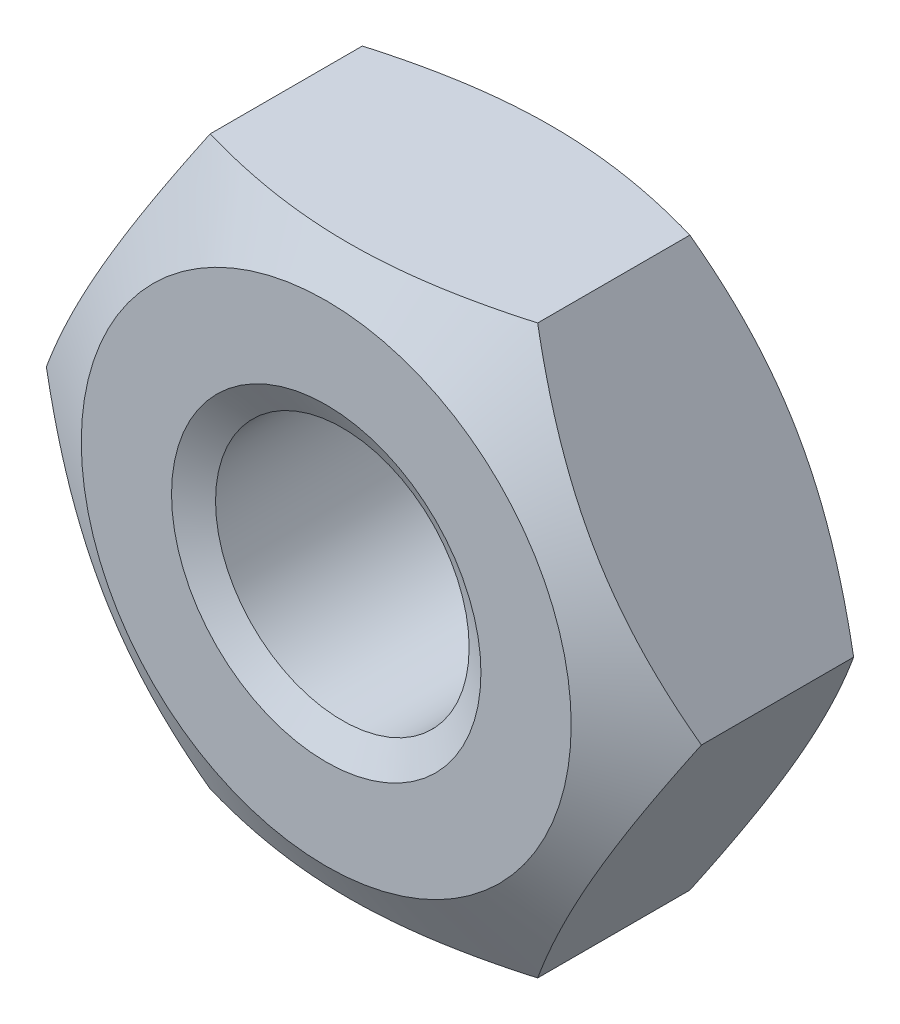
ISO-10303-21;
HEADER;
FILE_DESCRIPTION(('STEP AP214'),'2;1');
FILE_NAME('part.step','',(''),(''),'','','');
FILE_SCHEMA(('AUTOMOTIVE_DESIGN { 1 0 10303 214 1 1 1 1 }'));
ENDSEC;
DATA;
#1=APPLICATION_CONTEXT('core data for automotive mechanical design processes');
#2=APPLICATION_PROTOCOL_DEFINITION('international standard','automotive_design',2000,#1);
#3=PRODUCT_CONTEXT('',#1,'mechanical');
#4=PRODUCT('Part','Part','',(#3));
#5=PRODUCT_RELATED_PRODUCT_CATEGORY('part','',(#4));
#6=PRODUCT_DEFINITION_FORMATION('','',#4);
#7=PRODUCT_DEFINITION_CONTEXT('part definition',#1,'design');
#8=PRODUCT_DEFINITION('design','',#6,#7);
#9=PRODUCT_DEFINITION_SHAPE('','',#8);
#10=(LENGTH_UNIT() NAMED_UNIT(*) SI_UNIT(.MILLI.,.METRE.));
#11=(NAMED_UNIT(*) PLANE_ANGLE_UNIT() SI_UNIT($,.RADIAN.));
#12=(NAMED_UNIT(*) SI_UNIT($,.STERADIAN.) SOLID_ANGLE_UNIT());
#13=UNCERTAINTY_MEASURE_WITH_UNIT(LENGTH_MEASURE(1.E-05),#10,'distance_accuracy_value','');
#14=(GEOMETRIC_REPRESENTATION_CONTEXT(3) GLOBAL_UNCERTAINTY_ASSIGNED_CONTEXT((#13)) GLOBAL_UNIT_ASSIGNED_CONTEXT((#10,
#11,#12)) REPRESENTATION_CONTEXT('',''));
#15=CARTESIAN_POINT('',(0.,0.,0.));
#16=DIRECTION('',(0.,0.,1.));
#17=DIRECTION('',(1.,0.,0.));
#18=AXIS2_PLACEMENT_3D('',#15,#16,#17);
#19=CARTESIAN_POINT('',(1.58771324027146,-2.74999999999978,-2.4));
#20=DIRECTION('',(0.866025403784438,-0.5,0.));
#21=DIRECTION('',(0.5,0.86602540378444,0.));
#22=AXIS2_PLACEMENT_3D('',#19,#20,#21);
#23=PLANE('',#22);
#24=CARTESIAN_POINT('',(1.58759777021764,-2.75019999999979,-0.462193114310863));
#25=CARTESIAN_POINT('',(1.65737010029696,-2.6293507793399,-0.421894013195297));
#26=CARTESIAN_POINT('',(1.7277446998353,-2.50745839737718,-0.385243253543676));
#27=CARTESIAN_POINT('',(1.86971254686998,-2.26156287327195,-0.32126853391581));
#28=CARTESIAN_POINT('',(1.94130831721578,-2.137555361426,-0.293967206620522));
#29=CARTESIAN_POINT('',(2.08361254889592,-1.89107720202393,-0.251468096240143));
#30=CARTESIAN_POINT('',(2.15429911309856,-1.76864448141246,-0.235987469568471));
#31=CARTESIAN_POINT('',(2.29600490065916,-1.523202857631,-0.217505748315996));
#32=CARTESIAN_POINT('',(2.367023608844,-1.40019484676703,-0.214489350408711));
#33=CARTESIAN_POINT('',(2.49972966594892,-1.17034121338915,-0.220759496374651));
#34=CARTESIAN_POINT('',(2.56143686540065,-1.0634612087459,-0.22850650522276));
#35=CARTESIAN_POINT('',(2.68444923614037,-0.850397532665147,-0.253061532010381));
#36=CARTESIAN_POINT('',(2.74575398185,-0.744214598351011,-0.269877940596612));
#37=CARTESIAN_POINT('',(2.86902004703199,-0.530711510606716,-0.311918273292011));
#38=CARTESIAN_POINT('',(2.93096576264311,-0.42341838385704,-0.337320431633282));
#39=CARTESIAN_POINT('',(3.05393320806127,-0.210432520715841,-0.39497357678604));
#40=CARTESIAN_POINT('',(3.11495651365989,-0.104737054973241,-0.427211014245052));
#41=CARTESIAN_POINT('',(3.17554195059674,0.000200000000089018,-0.462193114310865));
#42=B_SPLINE_CURVE_WITH_KNOTS('',3,(#24,#25,#26,#27,#28,#29,#30,#31,#32,#33,#34,#35,#36,#37,#38,
#39,#40,#41),.UNSPECIFIED.,.F.,.F.,(4,2,2,2,2,2,2,2,4),(0.,0.43591282872586,0.872873557116257,
1.2990193190466,1.72464171213559,2.09526089052924,2.46622354066362,2.84541551798546,
3.22386274754515),.UNSPECIFIED.);
#43=CARTESIAN_POINT('',(1.58771324027146,-2.74999999999978,-0.462126444007965));
#44=VERTEX_POINT('',#43);
#45=CARTESIAN_POINT('',(3.17542648054292,-1.94289029309402E-13,-0.462126444007965));
#46=VERTEX_POINT('',#45);
#47=EDGE_CURVE('E52',#44,#46,#42,.T.);
#48=ORIENTED_EDGE('',*,*,#47,.F.);
#49=DIRECTION('',(0.,0.,1.));
#50=VECTOR('',#49,1.);
#51=CARTESIAN_POINT('',(1.58771324027146,-2.74999999999978,-2.4));
#52=LINE('',#51,#50);
#53=CARTESIAN_POINT('',(1.58771324027146,-2.74999999999978,-1.93787355599203));
#54=VERTEX_POINT('',#53);
#55=EDGE_CURVE('E116',#54,#44,#52,.T.);
#56=ORIENTED_EDGE('',*,*,#55,.F.);
#57=CARTESIAN_POINT('',(3.17554195059674,0.000200000000089018,-1.93780688568913));
#58=CARTESIAN_POINT('',(3.10576962051736,-0.120649220659793,-1.97810598680467));
#59=CARTESIAN_POINT('',(3.03539502097901,-0.242541602622515,-2.01475674645628));
#60=CARTESIAN_POINT('',(2.89342717394432,-0.488437126727769,-2.07873146608414));
#61=CARTESIAN_POINT('',(2.82183140359853,-0.612444638573731,-2.10603279337944));
#62=CARTESIAN_POINT('',(2.67952717191836,-0.858922797975804,-2.14853190375984));
#63=CARTESIAN_POINT('',(2.60884060771569,-0.981355518587263,-2.16401253043152));
#64=CARTESIAN_POINT('',(2.46713482015516,-1.22679714236879,-2.182494251684));
#65=CARTESIAN_POINT('',(2.39611611197042,-1.34980515323283,-2.18551064959129));
#66=CARTESIAN_POINT('',(2.26341005486548,-1.5796587866107,-2.17924050362535));
#67=CARTESIAN_POINT('',(2.20170285541366,-1.68653879125389,-2.17149349477725));
#68=CARTESIAN_POINT('',(2.07869048467388,-1.89960246733458,-2.14693846798964));
#69=CARTESIAN_POINT('',(2.01738573896428,-2.00578540164872,-2.13012205940341));
#70=CARTESIAN_POINT('',(1.89411967378232,-2.21928848939301,-2.08808172670803));
#71=CARTESIAN_POINT('',(1.8321739581712,-2.32658161614268,-2.06267956836677));
#72=CARTESIAN_POINT('',(1.70920651275305,-2.53956747928386,-2.00502642321401));
#73=CARTESIAN_POINT('',(1.64818320715444,-2.64526294502645,-1.97278898575498));
#74=CARTESIAN_POINT('',(1.58759777021764,-2.75019999999979,-1.93780688568914));
#75=B_SPLINE_CURVE_WITH_KNOTS('',3,(#57,#58,#59,#60,#61,#62,#63,#64,#65,#66,#67,#68,#69,#70,#71,
#72,#73,#74),.UNSPECIFIED.,.F.,.F.,(4,2,2,2,2,2,2,2,4),(0.,0.435912828725891,0.87287355711632,
1.29901931904669,1.72464171213571,2.09526089052934,2.46622354066368,2.84541551798549,
3.22386274754515),.UNSPECIFIED.);
#76=CARTESIAN_POINT('',(3.17542648054292,-1.94289029309402E-13,-1.93787355599203));
#77=VERTEX_POINT('',#76);
#78=EDGE_CURVE('E127',#77,#54,#75,.T.);
#79=ORIENTED_EDGE('',*,*,#78,.F.);
#80=DIRECTION('',(0.,0.,1.));
#81=VECTOR('',#80,1.);
#82=CARTESIAN_POINT('',(3.17542648054292,-1.94289029309402E-13,-2.4));
#83=LINE('',#82,#81);
#84=EDGE_CURVE('E124',#77,#46,#83,.T.);
#85=ORIENTED_EDGE('',*,*,#84,.T.);
#86=EDGE_LOOP('',(#48,#56,#79,#85));
#87=FACE_BOUND('',#86,.T.);
#88=ADVANCED_FACE('F37',(#87),#23,.T.);
#89=CARTESIAN_POINT('',(-1.58771324027154,-2.75000000000003,-2.4));
#90=DIRECTION('',(0.,-1.,0.));
#91=DIRECTION('',(1.,0.,0.));
#92=AXIS2_PLACEMENT_3D('',#89,#90,#91);
#93=PLANE('',#92);
#94=CARTESIAN_POINT('',(-4.18089404109678,-2.74999999999986,-1.5179899415649));
#95=CARTESIAN_POINT('',(-4.06145245237556,-2.74999999999997,-1.46039265494814));
#96=CARTESIAN_POINT('',(-3.94172745739258,-2.75000000000001,-1.40337252294118));
#97=CARTESIAN_POINT('',(-3.70155957974341,-2.75000000000005,-1.29081302464414));
#98=CARTESIAN_POINT('',(-3.58111657931915,-2.75000000000004,-1.23527390990987));
#99=CARTESIAN_POINT('',(-3.33869981593333,-2.75000000000003,-1.12570526534726));
#100=CARTESIAN_POINT('',(-3.21672122509043,-2.75000000000003,-1.07168637831681));
#101=CARTESIAN_POINT('',(-2.97176387195391,-2.75000000000003,-0.965974730738015));
#102=CARTESIAN_POINT('',(-2.84878515993438,-2.75000000000003,-0.914281854108803));
#103=CARTESIAN_POINT('',(-2.59801833041915,-2.75000000000003,-0.812370691522454));
#104=CARTESIAN_POINT('',(-2.47019461470086,-2.75000000000003,-0.762239500848192));
#105=CARTESIAN_POINT('',(-2.21302109467106,-2.75000000000003,-0.665978542317032));
#106=CARTESIAN_POINT('',(-2.08367111671391,-2.75000000000001,-0.619849234846822));
#107=CARTESIAN_POINT('',(-1.82350982585363,-2.75000000000005,-0.532864834631992));
#108=CARTESIAN_POINT('',(-1.69270238031663,-2.75000000000009,-0.491998296068808));
#109=CARTESIAN_POINT('',(-1.42921402775582,-2.74999999999997,-0.416905589332189));
#110=CARTESIAN_POINT('',(-1.2965337519044,-2.74999999999981,-0.382677238723994));
#111=CARTESIAN_POINT('',(-1.02993488525594,-2.74999999999981,-0.322732243741703));
#112=CARTESIAN_POINT('',(-0.89602598456185,-2.74999999999997,-0.296973320704408));
#113=CARTESIAN_POINT('',(-0.62663498378018,-2.75000000000009,-0.255482468737643));
#114=CARTESIAN_POINT('',(-0.491153007280513,-2.75000000000005,-0.239749757459092));
#115=CARTESIAN_POINT('',(-0.22102509274459,-2.75000000000001,-0.219773084073614));
#116=CARTESIAN_POINT('',(-0.086389843895749,-2.75000000000001,-0.215388098750885));
#117=CARTESIAN_POINT('',(0.182772999691287,-2.75000000000005,-0.218112149203658));
#118=CARTESIAN_POINT('',(0.317300590178871,-2.7500000000001,-0.225221618377822));
#119=CARTESIAN_POINT('',(0.548252604763228,-2.75000000000008,-0.246804818907627));
#120=CARTESIAN_POINT('',(0.644930985653332,-2.75000000000004,-0.258699845560606));
#121=CARTESIAN_POINT('',(0.837521457226654,-2.75000000000002,-0.287638177842868));
#122=CARTESIAN_POINT('',(0.933433430569607,-2.75000000000002,-0.304682256878983));
#123=CARTESIAN_POINT('',(1.21991208424577,-2.75000000000004,-0.362638484165309));
#124=CARTESIAN_POINT('',(1.40910271367788,-2.75000000000004,-0.410362118674417));
#125=CARTESIAN_POINT('',(1.78760227887408,-2.75000000000002,-0.520047971913256));
#126=CARTESIAN_POINT('',(1.9768251542779,-2.75000000000001,-0.582296002085853));
#127=CARTESIAN_POINT('',(2.2580536814294,-2.75000000000004,-0.682727403866339));
#128=CARTESIAN_POINT('',(2.35135026634848,-2.75000000000006,-0.717376134035639));
#129=CARTESIAN_POINT('',(2.53718476011062,-2.75,-0.788651946984273));
#130=CARTESIAN_POINT('',(2.62972267610489,-2.7499999999999,-0.825279011091111));
#131=CARTESIAN_POINT('',(2.8404503667325,-2.74999999999987,-0.910865046702272));
#132=CARTESIAN_POINT('',(2.9584219301369,-2.74999999999999,-0.960359603371709));
#133=CARTESIAN_POINT('',(3.19343458662391,-2.75000000000007,-1.06151525338514));
#134=CARTESIAN_POINT('',(3.31047563757561,-2.75000000000004,-1.11317644417099));
#135=CARTESIAN_POINT('',(3.66046723285523,-2.75,-1.27076592621051));
#136=CARTESIAN_POINT('',(3.89224992259007,-2.75000000000002,-1.3792850594017));
#137=CARTESIAN_POINT('',(4.35380078666026,-2.75000000000004,-1.60098562764638));
#138=CARTESIAN_POINT('',(4.58356703256496,-2.75000000000003,-1.71417103744141));
#139=CARTESIAN_POINT('',(5.0415070804254,-2.75000000000003,-1.94372902201353));
#140=CARTESIAN_POINT('',(5.26968083158572,-2.75000000000003,-2.06010169787637));
#141=CARTESIAN_POINT('',(5.70709508397922,-2.75000000000003,-2.28596205355109));
#142=CARTESIAN_POINT('',(5.91642416090194,-2.75000000000003,-2.39527874580898));
#143=CARTESIAN_POINT('',(6.33431390674271,-2.75000000000003,-2.61538392303365));
#144=CARTESIAN_POINT('',(6.54287455353958,-2.75000000000003,-2.72617244995449));
#145=CARTESIAN_POINT('',(6.95894552429486,-2.75000000000003,-2.94864105559347));
#146=CARTESIAN_POINT('',(7.16645714062628,-2.75000000000004,-3.06031872069686));
#147=CARTESIAN_POINT('',(7.58098475738656,-2.75000000000002,-3.28456710913354));
#148=CARTESIAN_POINT('',(7.78800078084957,-2.75,-3.39713778986942));
#149=CARTESIAN_POINT('',(7.9948321916235,-2.74999999999995,-3.5100443769047));
#150=B_SPLINE_CURVE_WITH_KNOTS('',3,(#94,#95,#96,#97,#98,#99,#100,#101,#102,#103,#104,#105,#106,
#107,#108,#109,#110,#111,#112,#113,#114,#115,#116,#117,#118,#119,#120,#121,#122,#123,#124,#125,
#126,#127,#128,#129,#130,#131,#132,#133,#134,#135,#136,#137,#138,#139,#140,#141,#142,#143,#144,
#145,#146,#147,#148,#149),.UNSPECIFIED.,.F.,.F.,(4,2,2,2,2,2,2,2,2,2,2,2,2,2,2,2,2,2,2,2,2,2,2,
2,2,2,2,4),(0.,0.397816384716487,0.795699914972352,1.19589465474622,1.59606940037379,
2.00792584811721,2.41982961420225,2.83082184589578,3.2416787258972,3.65045235273648,
4.05919407890895,4.46283124557034,4.86648363173498,5.15856361051855,5.45068748263325,
6.03529190386406,6.63254893986654,6.93109984122847,7.22964792521124,7.61342081441358,
7.99721098190227,8.76490916316755,9.53327535803852,10.3016659503116,11.0101216750495,
11.7185976375507,12.4255583295764,13.1324854995101),.UNSPECIFIED.);
#151=CARTESIAN_POINT('',(-1.58771324027154,-2.75000000000003,-0.462126444007966));
#152=VERTEX_POINT('',#151);
#153=EDGE_CURVE('E109',#152,#44,#150,.T.);
#154=ORIENTED_EDGE('',*,*,#153,.F.);
#155=DIRECTION('',(0.,0.,1.));
#156=VECTOR('',#155,1.);
#157=CARTESIAN_POINT('',(-1.58771324027154,-2.75000000000003,-2.4));
#158=LINE('',#157,#156);
#159=CARTESIAN_POINT('',(-1.58771324027154,-2.75000000000003,-1.93787355599203));
#160=VERTEX_POINT('',#159);
#161=EDGE_CURVE('E108',#160,#152,#158,.T.);
#162=ORIENTED_EDGE('',*,*,#161,.F.);
#163=CARTESIAN_POINT('',(-4.18089404109678,-2.74999999999986,-0.882010058435098));
#164=CARTESIAN_POINT('',(-4.06145245237556,-2.74999999999997,-0.939607345051861));
#165=CARTESIAN_POINT('',(-3.94172745739258,-2.75000000000001,-0.996627477058812));
#166=CARTESIAN_POINT('',(-3.70155957974341,-2.75000000000005,-1.10918697535586));
#167=CARTESIAN_POINT('',(-3.58111657931915,-2.75000000000004,-1.16472609009012));
#168=CARTESIAN_POINT('',(-3.33869981593333,-2.75000000000003,-1.27429473465274));
#169=CARTESIAN_POINT('',(-3.21672122509043,-2.75000000000003,-1.32831362168319));
#170=CARTESIAN_POINT('',(-2.97176387195391,-2.75000000000003,-1.43402526926198));
#171=CARTESIAN_POINT('',(-2.84878515993438,-2.75000000000003,-1.4857181458912));
#172=CARTESIAN_POINT('',(-2.59801833041915,-2.75000000000003,-1.58762930847754));
#173=CARTESIAN_POINT('',(-2.47019461470086,-2.75000000000003,-1.63776049915181));
#174=CARTESIAN_POINT('',(-2.21302109467106,-2.75000000000003,-1.73402145768297));
#175=CARTESIAN_POINT('',(-2.08367111671391,-2.75000000000001,-1.78015076515318));
#176=CARTESIAN_POINT('',(-1.82350982585363,-2.75000000000005,-1.86713516536801));
#177=CARTESIAN_POINT('',(-1.69270238031663,-2.75000000000009,-1.90800170393119));
#178=CARTESIAN_POINT('',(-1.42921402775582,-2.74999999999997,-1.98309441066781));
#179=CARTESIAN_POINT('',(-1.2965337519044,-2.74999999999981,-2.01732276127601));
#180=CARTESIAN_POINT('',(-1.02993488525594,-2.74999999999981,-2.0772677562583));
#181=CARTESIAN_POINT('',(-0.89602598456185,-2.74999999999997,-2.10302667929559));
#182=CARTESIAN_POINT('',(-0.62663498378018,-2.75000000000009,-2.14451753126236));
#183=CARTESIAN_POINT('',(-0.491153007280514,-2.75000000000005,-2.16025024254091));
#184=CARTESIAN_POINT('',(-0.22102509274459,-2.75000000000001,-2.18022691592639));
#185=CARTESIAN_POINT('',(-0.0863898438957489,-2.75000000000001,-2.18461190124911));
#186=CARTESIAN_POINT('',(0.182772999691287,-2.75000000000005,-2.18188785079634));
#187=CARTESIAN_POINT('',(0.317300590178871,-2.7500000000001,-2.17477838162218));
#188=CARTESIAN_POINT('',(0.548252604763228,-2.75000000000008,-2.15319518109237));
#189=CARTESIAN_POINT('',(0.644930985653332,-2.75000000000004,-2.14130015443939));
#190=CARTESIAN_POINT('',(0.837521457226653,-2.75000000000002,-2.11236182215713));
#191=CARTESIAN_POINT('',(0.933433430569607,-2.75000000000002,-2.09531774312102));
#192=CARTESIAN_POINT('',(1.21991208424577,-2.75000000000004,-2.03736151583469));
#193=CARTESIAN_POINT('',(1.40910271367788,-2.75000000000004,-1.98963788132558));
#194=CARTESIAN_POINT('',(1.78760227887408,-2.75000000000002,-1.87995202808674));
#195=CARTESIAN_POINT('',(1.9768251542779,-2.75000000000001,-1.81770399791415));
#196=CARTESIAN_POINT('',(2.2580536814294,-2.75000000000004,-1.71727259613366));
#197=CARTESIAN_POINT('',(2.35135026634848,-2.75000000000006,-1.68262386596436));
#198=CARTESIAN_POINT('',(2.53718476011062,-2.75,-1.61134805301573));
#199=CARTESIAN_POINT('',(2.62972267610489,-2.7499999999999,-1.57472098890889));
#200=CARTESIAN_POINT('',(2.8404503667325,-2.74999999999987,-1.48913495329773));
#201=CARTESIAN_POINT('',(2.9584219301369,-2.74999999999999,-1.43964039662829));
#202=CARTESIAN_POINT('',(3.19343458662391,-2.75000000000007,-1.33848474661485));
#203=CARTESIAN_POINT('',(3.3104756375756,-2.75000000000004,-1.28682355582901));
#204=CARTESIAN_POINT('',(3.66046723285523,-2.75,-1.12923407378948));
#205=CARTESIAN_POINT('',(3.89224992259007,-2.75000000000002,-1.02071494059829));
#206=CARTESIAN_POINT('',(4.35380078666026,-2.75000000000004,-0.799014372353613));
#207=CARTESIAN_POINT('',(4.58356703256496,-2.75000000000003,-0.685828962558591));
#208=CARTESIAN_POINT('',(5.0415070804254,-2.75000000000003,-0.456270977986464));
#209=CARTESIAN_POINT('',(5.26968083158572,-2.75000000000003,-0.339898302123622));
#210=CARTESIAN_POINT('',(5.70709508397922,-2.75000000000003,-0.114037946448903));
#211=CARTESIAN_POINT('',(5.91642416090194,-2.75000000000003,-0.00472125419101548));
#212=CARTESIAN_POINT('',(6.33431390674271,-2.75000000000003,0.215383923033654));
#213=CARTESIAN_POINT('',(6.54287455353958,-2.75000000000003,0.326172449954498));
#214=CARTESIAN_POINT('',(6.95894552429486,-2.75000000000003,0.548641055593478));
#215=CARTESIAN_POINT('',(7.16645714062628,-2.75000000000004,0.660318720696867));
#216=CARTESIAN_POINT('',(7.58098475738656,-2.75000000000002,0.884567109133543));
#217=CARTESIAN_POINT('',(7.78800078084957,-2.75,0.997137789869419));
#218=CARTESIAN_POINT('',(7.9948321916235,-2.74999999999995,1.11004437690471));
#219=B_SPLINE_CURVE_WITH_KNOTS('',3,(#163,#164,#165,#166,#167,#168,#169,#170,#171,#172,#173,
#174,#175,#176,#177,#178,#179,#180,#181,#182,#183,#184,#185,#186,#187,#188,#189,#190,#191,#192,
#193,#194,#195,#196,#197,#198,#199,#200,#201,#202,#203,#204,#205,#206,#207,#208,#209,#210,#211,
#212,#213,#214,#215,#216,#217,#218),.UNSPECIFIED.,.F.,.F.,(4,2,2,2,2,2,2,2,2,2,2,2,2,2,2,2,2,2,
2,2,2,2,2,2,2,2,2,4),(0.,0.397816384716487,0.795699914972351,1.19589465474621,1.59606940037379,
2.00792584811721,2.41982961420225,2.83082184589578,3.24167872589721,3.65045235273648,
4.05919407890896,4.46283124557034,4.86648363173498,5.15856361051855,5.45068748263325,
6.03529190386406,6.63254893986654,6.93109984122847,7.22964792521124,7.61342081441358,
7.99721098190227,8.76490916316755,9.53327535803852,10.3016659503116,11.0101216750495,
11.7185976375507,12.4255583295764,13.1324854995101),.UNSPECIFIED.);
#220=EDGE_CURVE('E198',#54,#160,#219,.F.);
#221=ORIENTED_EDGE('',*,*,#220,.F.);
#222=ORIENTED_EDGE('',*,*,#55,.T.);
#223=EDGE_LOOP('',(#154,#162,#221,#222));
#224=FACE_BOUND('',#223,.T.);
#225=ADVANCED_FACE('F206',(#224),#93,.T.);
#226=CARTESIAN_POINT('',(-3.17542648054303,1.11022302462516E-13,-2.4));
#227=DIRECTION('',(-0.866025403784438,-0.500000000000001,0.));
#228=DIRECTION('',(0.5,-0.86602540378444,0.));
#229=AXIS2_PLACEMENT_3D('',#226,#227,#228);
#230=PLANE('',#229);
#231=CARTESIAN_POINT('',(-3.17554195059666,0.000200000000116773,-0.462193114310863));
#232=CARTESIAN_POINT('',(-3.10576962051741,-0.12064922065985,-0.421894013195382));
#233=CARTESIAN_POINT('',(-3.03539502097911,-0.242541602622599,-0.385243253543786));
#234=CARTESIAN_POINT('',(-2.89342717394444,-0.488437126727868,-0.321268533915929));
#235=CARTESIAN_POINT('',(-2.82183140359863,-0.612444638573819,-0.293967206620623));
#236=CARTESIAN_POINT('',(-2.67952717191847,-0.858922797975901,-0.251468096240242));
#237=CARTESIAN_POINT('',(-2.60884060771583,-0.981355518587378,-0.235987469568584));
#238=CARTESIAN_POINT('',(-2.46713482015523,-1.22679714236885,-0.217505748316058));
#239=CARTESIAN_POINT('',(-2.39611611197038,-1.34980515323283,-0.214489350408707));
#240=CARTESIAN_POINT('',(-2.26341005486546,-1.5796587866107,-0.22075949637465));
#241=CARTESIAN_POINT('',(-2.20170285541374,-1.68653879125394,-0.228506505222809));
#242=CARTESIAN_POINT('',(-2.07869048467404,-1.89960246733466,-0.253061532010459));
#243=CARTESIAN_POINT('',(-2.01738573896442,-2.00578540164878,-0.269877940596669));
#244=CARTESIAN_POINT('',(-1.89411967378244,-2.21928848939306,-0.31191827329204));
#245=CARTESIAN_POINT('',(-1.83217395817134,-2.32658161614273,-0.337320431633306));
#246=CARTESIAN_POINT('',(-1.70920651275317,-2.5395674792839,-0.394973576786055));
#247=CARTESIAN_POINT('',(-1.64818320715452,-2.64526294502646,-0.427211014245062));
#248=CARTESIAN_POINT('',(-1.58759777021758,-2.75019999999973,-0.462193114310863));
#249=B_SPLINE_CURVE_WITH_KNOTS('',3,(#231,#232,#233,#234,#235,#236,#237,#238,#239,#240,#241,
#242,#243,#244,#245,#246,#247,#248),.UNSPECIFIED.,.F.,.F.,(4,2,2,2,2,2,2,2,4),(0.,
0.435912828725877,0.872873557116311,1.29901931904668,1.72464171213569,2.0952608905293,
2.46622354066364,2.84541551798544,3.22386274754508),.UNSPECIFIED.);
#250=CARTESIAN_POINT('',(-3.17542648054303,1.11022302462516E-13,-0.462126444007965));
#251=VERTEX_POINT('',#250);
#252=EDGE_CURVE('E92',#251,#152,#249,.T.);
#253=ORIENTED_EDGE('',*,*,#252,.F.);
#254=DIRECTION('',(0.,0.,1.));
#255=VECTOR('',#254,1.);
#256=CARTESIAN_POINT('',(-3.17542648054303,1.11022302462516E-13,-2.4));
#257=LINE('',#256,#255);
#258=CARTESIAN_POINT('',(-3.17542648054303,1.11022302462516E-13,-1.93787355599203));
#259=VERTEX_POINT('',#258);
#260=EDGE_CURVE('E106',#259,#251,#257,.T.);
#261=ORIENTED_EDGE('',*,*,#260,.F.);
#262=CARTESIAN_POINT('',(-1.58759777021758,-2.75019999999973,-1.93780688568914));
#263=CARTESIAN_POINT('',(-1.65737010029704,-2.6293507793399,-1.97810598680466));
#264=CARTESIAN_POINT('',(-1.72774469983542,-2.50745839737721,-2.01475674645626));
#265=CARTESIAN_POINT('',(-1.86971254687014,-2.26156287327199,-2.07873146608412));
#266=CARTESIAN_POINT('',(-1.94130831721592,-2.13755536142602,-2.10603279337942));
#267=CARTESIAN_POINT('',(-2.08361254889607,-1.89107720202395,-2.14853190375978));
#268=CARTESIAN_POINT('',(-2.15429911309873,-1.76864448141249,-2.16401253043143));
#269=CARTESIAN_POINT('',(-2.29600490065929,-1.523202857631,-2.18249425168395));
#270=CARTESIAN_POINT('',(-2.36702360884408,-1.400194846767,-2.1855106495913));
#271=CARTESIAN_POINT('',(-2.49972966594901,-1.17034121338913,-2.17924050362534));
#272=CARTESIAN_POINT('',(-2.56143686540078,-1.06346120874592,-2.17149349477718));
#273=CARTESIAN_POINT('',(-2.68444923614052,-0.850397532665205,-2.14693846798952));
#274=CARTESIAN_POINT('',(-2.74575398185013,-0.744214598351065,-2.1301220594033));
#275=CARTESIAN_POINT('',(-2.86902004703211,-0.53071151060678,-2.08808172670792));
#276=CARTESIAN_POINT('',(-2.93096576264324,-0.423418383857119,-2.06267956836664));
#277=CARTESIAN_POINT('',(-3.05393320806136,-0.210432520715912,-2.00502642321389));
#278=CARTESIAN_POINT('',(-3.11495651365994,-0.10473705497329,-1.9727889857549));
#279=CARTESIAN_POINT('',(-3.17554195059666,0.000200000000116773,-1.93780688568914));
#280=B_SPLINE_CURVE_WITH_KNOTS('',3,(#262,#263,#264,#265,#266,#267,#268,#269,#270,#271,#272,
#273,#274,#275,#276,#277,#278,#279),.UNSPECIFIED.,.F.,.F.,(4,2,2,2,2,2,2,2,4),(0.,
0.435912828725859,0.872873557116274,1.29901931904663,1.72464171213562,2.09526089052924,
2.4662235406636,2.84541551798542,3.22386274754508),.UNSPECIFIED.);
#281=EDGE_CURVE('E192',#160,#259,#280,.T.);
#282=ORIENTED_EDGE('',*,*,#281,.F.);
#283=ORIENTED_EDGE('',*,*,#161,.T.);
#284=EDGE_LOOP('',(#253,#261,#282,#283));
#285=FACE_BOUND('',#284,.T.);
#286=ADVANCED_FACE('F104',(#285),#230,.T.);
#287=CARTESIAN_POINT('',(-1.58771324027152,2.75000000000011,-2.4));
#288=DIRECTION('',(-0.866025403784438,0.5,0.));
#289=DIRECTION('',(-0.5,-0.86602540378444,0.));
#290=AXIS2_PLACEMENT_3D('',#287,#288,#289);
#291=PLANE('',#290);
#292=CARTESIAN_POINT('',(-1.58759777021761,2.75020000000004,-0.462193114310863));
#293=CARTESIAN_POINT('',(-1.65737010029702,2.62935077934016,-0.421894013195411));
#294=CARTESIAN_POINT('',(-1.72774469983538,2.50745839737745,-0.385243253543825));
#295=CARTESIAN_POINT('',(-1.86971254687008,2.26156287327222,-0.321268533915974));
#296=CARTESIAN_POINT('',(-1.94130831721587,2.13755536142626,-0.293967206620665));
#297=CARTESIAN_POINT('',(-2.08361254889603,1.89107720202418,-0.25146809624029));
#298=CARTESIAN_POINT('',(-2.15429911309869,1.76864448141272,-0.235987469568642));
#299=CARTESIAN_POINT('',(-2.29600490065924,1.52320285763123,-0.217505748316092));
#300=CARTESIAN_POINT('',(-2.36702360884402,1.40019484676722,-0.214489350408707));
#301=CARTESIAN_POINT('',(-2.49972966594896,1.17034121338935,-0.220759496374652));
#302=CARTESIAN_POINT('',(-2.56143686540074,1.06346120874613,-0.228506505222841));
#303=CARTESIAN_POINT('',(-2.6844492361405,0.850397532665395,-0.253061532010514));
#304=CARTESIAN_POINT('',(-2.74575398185011,0.744214598351243,-0.269877940596718));
#305=CARTESIAN_POINT('',(-2.86902004703211,0.530711510606931,-0.311918273292096));
#306=CARTESIAN_POINT('',(-2.93096576264324,0.423418383857255,-0.337320431633375));
#307=CARTESIAN_POINT('',(-3.05393320806139,0.210432520716035,-0.394973576786122));
#308=CARTESIAN_POINT('',(-3.11495651365999,0.104737054973413,-0.427211014245114));
#309=CARTESIAN_POINT('',(-3.17554195059677,-0.000199999999977996,-0.462193114310863));
#310=B_SPLINE_CURVE_WITH_KNOTS('',3,(#292,#293,#294,#295,#296,#297,#298,#299,#300,#301,#302,
#303,#304,#305,#306,#307,#308,#309),.UNSPECIFIED.,.F.,.F.,(4,2,2,2,2,2,2,2,4),(0.,
0.435912828725856,0.872873557116278,1.29901931904664,1.72464171213563,2.09526089052929,
2.46622354066369,2.84541551798555,3.22386274754524),.UNSPECIFIED.);
#311=CARTESIAN_POINT('',(-1.58771324027152,2.75000000000011,-0.462126444007964));
#312=VERTEX_POINT('',#311);
#313=EDGE_CURVE('E88',#312,#251,#310,.T.);
#314=ORIENTED_EDGE('',*,*,#313,.F.);
#315=DIRECTION('',(0.,0.,1.));
#316=VECTOR('',#315,1.);
#317=CARTESIAN_POINT('',(-1.58771324027152,2.75000000000011,-2.4));
#318=LINE('',#317,#316);
#319=CARTESIAN_POINT('',(-1.58771324027152,2.75000000000011,-1.93787355599203));
#320=VERTEX_POINT('',#319);
#321=EDGE_CURVE('E114',#320,#312,#318,.T.);
#322=ORIENTED_EDGE('',*,*,#321,.F.);
#323=CARTESIAN_POINT('',(-3.17554195059677,-0.000199999999977996,-1.93780688568914));
#324=CARTESIAN_POINT('',(-3.10576962051747,0.120649220659957,-1.9781059868046));
#325=CARTESIAN_POINT('',(-3.03539502097915,0.242541602622691,-2.01475674645619));
#326=CARTESIAN_POINT('',(-2.89342717394447,0.488437126727948,-2.07873146608404));
#327=CARTESIAN_POINT('',(-2.82183140359867,0.612444638573902,-2.10603279337935));
#328=CARTESIAN_POINT('',(-2.67952717191851,0.858922797975979,-2.14853190375972));
#329=CARTESIAN_POINT('',(-2.60884060771587,0.98135551858745,-2.16401253043136));
#330=CARTESIAN_POINT('',(-2.46713482015528,1.22679714236893,-2.18249425168391));
#331=CARTESIAN_POINT('',(-2.39611611197047,1.34980515323292,-2.1855106495913));
#332=CARTESIAN_POINT('',(-2.26341005486554,1.57965878661079,-2.17924050362535));
#333=CARTESIAN_POINT('',(-2.20170285541379,1.68653879125403,-2.17149349477715));
#334=CARTESIAN_POINT('',(-2.07869048467405,1.89960246733477,-2.14693846798948));
#335=CARTESIAN_POINT('',(-2.01738573896443,2.00578540164892,-2.13012205940327));
#336=CARTESIAN_POINT('',(-1.89411967378244,2.21928848939323,-2.08808172670789));
#337=CARTESIAN_POINT('',(-1.83217395817132,2.32658161614291,-2.06267956836661));
#338=CARTESIAN_POINT('',(-1.70920651275314,2.53956747928411,-2.00502642321386));
#339=CARTESIAN_POINT('',(-1.6481832071545,2.64526294502671,-1.97278898575487));
#340=CARTESIAN_POINT('',(-1.58759777021761,2.75020000000004,-1.93780688568914));
#341=B_SPLINE_CURVE_WITH_KNOTS('',3,(#323,#324,#325,#326,#327,#328,#329,#330,#331,#332,#333,
#334,#335,#336,#337,#338,#339,#340),.UNSPECIFIED.,.F.,.F.,(4,2,2,2,2,2,2,2,4),(0.,
0.435912828725861,0.872873557116288,1.29901931904665,1.72464171213565,2.09526089052931,
2.4662235406637,2.84541551798555,3.22386274754524),.UNSPECIFIED.);
#342=EDGE_CURVE('E113',#259,#320,#341,.T.);
#343=ORIENTED_EDGE('',*,*,#342,.F.);
#344=ORIENTED_EDGE('',*,*,#260,.T.);
#345=EDGE_LOOP('',(#314,#322,#343,#344));
#346=FACE_BOUND('',#345,.T.);
#347=ADVANCED_FACE('F112',(#346),#291,.T.);
#348=CARTESIAN_POINT('',(1.58771324027149,2.75000000000009,-2.4));
#349=DIRECTION('',(0.,1.,0.));
#350=DIRECTION('',(0.,0.,1.));
#351=AXIS2_PLACEMENT_3D('',#348,#349,#350);
#352=PLANE('',#351);
#353=CARTESIAN_POINT('',(-4.18089404107411,2.75000000000014,-1.51798994155391));
#354=CARTESIAN_POINT('',(-4.06145245235363,2.75000000000011,-1.46039265493764));
#355=CARTESIAN_POINT('',(-3.94172745737141,2.75000000000009,-1.40337252293117));
#356=CARTESIAN_POINT('',(-3.70155957972376,2.75000000000008,-1.29081302463506));
#357=CARTESIAN_POINT('',(-3.58111657930026,2.75000000000009,-1.23527390990125));
#358=CARTESIAN_POINT('',(-3.33869981591599,2.75000000000009,-1.12570526533955));
#359=CARTESIAN_POINT('',(-3.21672122507386,2.75000000000009,-1.07168637830956));
#360=CARTESIAN_POINT('',(-2.97176387193891,2.75000000000009,-0.965974730731682));
#361=CARTESIAN_POINT('',(-2.84878515992016,2.75000000000009,-0.914281854102921));
#362=CARTESIAN_POINT('',(-2.59801833040654,2.75000000000009,-0.812370691517484));
#363=CARTESIAN_POINT('',(-2.47019461468909,2.75000000000009,-0.762239500843681));
#364=CARTESIAN_POINT('',(-2.21302109466097,2.75000000000009,-0.66597854231341));
#365=CARTESIAN_POINT('',(-2.08367111670467,2.75000000000008,-0.619849234843631));
#366=CARTESIAN_POINT('',(-1.8235098258461,2.75000000000009,-0.532864834629628));
#367=CARTESIAN_POINT('',(-1.69270238030996,2.7500000000001,-0.49199829606684));
#368=CARTESIAN_POINT('',(-1.42921402775091,2.75000000000007,-0.416905589330914));
#369=CARTESIAN_POINT('',(-1.29653375190039,2.75000000000003,-0.382677238723015));
#370=CARTESIAN_POINT('',(-1.02993488525417,2.75000000000003,-0.322732243741366));
#371=CARTESIAN_POINT('',(-0.896025984561434,2.75000000000007,-0.296973320704391));
#372=CARTESIAN_POINT('',(-0.626634983782505,2.7500000000001,-0.255482468738017));
#373=CARTESIAN_POINT('',(-0.491153007284228,2.7500000000001,-0.239749757459539));
#374=CARTESIAN_POINT('',(-0.221025092751056,2.75000000000008,-0.219773084073986));
#375=CARTESIAN_POINT('',(-0.0863898439035779,2.75000000000007,-0.215388098751113));
#376=CARTESIAN_POINT('',(0.182772999680758,2.7500000000001,-0.218112149203309));
#377=CARTESIAN_POINT('',(0.317300590167005,2.75000000000015,-0.225221618377039));
#378=CARTESIAN_POINT('',(0.548252604749621,2.75000000000013,-0.246804818906081));
#379=CARTESIAN_POINT('',(0.644930985639308,2.7500000000001,-0.25869984555878));
#380=CARTESIAN_POINT('',(0.837521457211819,2.75000000000007,-0.28763817784042));
#381=CARTESIAN_POINT('',(0.933433430554379,2.75000000000008,-0.304682256876194));
#382=CARTESIAN_POINT('',(1.21991208422938,2.75000000000009,-0.3626384841615));
#383=CARTESIAN_POINT('',(1.40910271366074,2.75000000000009,-0.410362118669934));
#384=CARTESIAN_POINT('',(1.78760227885544,2.75000000000008,-0.520047971907414));
#385=CARTESIAN_POINT('',(1.97682515425851,2.75000000000009,-0.582296002079328));
#386=CARTESIAN_POINT('',(2.25805368140888,2.75000000000008,-0.682727403858849));
#387=CARTESIAN_POINT('',(2.35135026632758,2.75000000000008,-0.717376134027838));
#388=CARTESIAN_POINT('',(2.53718476008898,2.75000000000009,-0.788651946975805));
#389=CARTESIAN_POINT('',(2.62972267608289,2.75000000000011,-0.825279011082288));
#390=CARTESIAN_POINT('',(2.84045036671023,2.75000000000012,-0.910865046692964));
#391=CARTESIAN_POINT('',(2.95842193011469,2.75000000000009,-0.960359603362311));
#392=CARTESIAN_POINT('',(3.19343458660185,2.75000000000008,-1.06151525337553));
#393=CARTESIAN_POINT('',(3.31047563755363,2.75000000000008,-1.11317644416125));
#394=CARTESIAN_POINT('',(3.66046723283349,2.75000000000009,-1.27076592620046));
#395=CARTESIAN_POINT('',(3.89224992256846,2.75000000000009,-1.37928505939151));
#396=CARTESIAN_POINT('',(4.35380078663889,2.75000000000008,-1.60098562763596));
#397=CARTESIAN_POINT('',(4.5835670325437,2.75000000000008,-1.71417103743089));
#398=CARTESIAN_POINT('',(5.04150708040436,2.75000000000009,-1.94372902200287));
#399=CARTESIAN_POINT('',(5.26968083156478,2.75000000000008,-2.06010169786566));
#400=CARTESIAN_POINT('',(5.70709508395838,2.75000000000008,-2.28596205354027));
#401=CARTESIAN_POINT('',(5.91642416088112,2.75000000000008,-2.39527874579809));
#402=CARTESIAN_POINT('',(6.3343139067219,2.75000000000008,-2.61538392302264));
#403=CARTESIAN_POINT('',(6.54287455351878,2.75000000000008,-2.72617244994343));
#404=CARTESIAN_POINT('',(6.95894552427404,2.75000000000009,-2.94864105558231));
#405=CARTESIAN_POINT('',(7.16645714060545,2.75000000000009,-3.06031872068564));
#406=CARTESIAN_POINT('',(7.5809847573657,2.75000000000008,-3.28456710912223));
#407=CARTESIAN_POINT('',(7.78800078082869,2.75000000000006,-3.39713778985806));
#408=CARTESIAN_POINT('',(7.9948321916026,2.75000000000003,-3.51004437689331));
#409=B_SPLINE_CURVE_WITH_KNOTS('',3,(#353,#354,#355,#356,#357,#358,#359,#360,#361,#362,#363,
#364,#365,#366,#367,#368,#369,#370,#371,#372,#373,#374,#375,#376,#377,#378,#379,#380,#381,#382,
#383,#384,#385,#386,#387,#388,#389,#390,#391,#392,#393,#394,#395,#396,#397,#398,#399,#400,#401,
#402,#403,#404,#405,#406,#407,#408),.UNSPECIFIED.,.F.,.F.,(4,2,2,2,2,2,2,2,2,2,2,2,2,2,2,2,2,2,
2,2,2,2,2,2,2,2,2,4),(0.,0.397816384713822,0.795699914967022,1.1958946547382,1.59606940036309,
2.00792584810367,2.41982961418588,2.83082184587658,3.24167872587519,3.65045235271031,
4.05919407887863,4.46283124553596,4.86648363169654,5.15856361047877,5.45068748259213,
6.03529190382026,6.63254893981996,6.93109984118049,7.22964792516187,7.61342081436429,
7.99721098185305,8.76490916311851,9.53327535798966,10.3016659502629,11.0101216750007,
11.7185976375019,12.4255583295275,13.1324854994611),.UNSPECIFIED.);
#410=CARTESIAN_POINT('',(1.58771324027149,2.75000000000009,-0.462126444007964));
#411=VERTEX_POINT('',#410);
#412=EDGE_CURVE('E95',#411,#312,#409,.F.);
#413=ORIENTED_EDGE('',*,*,#412,.F.);
#414=DIRECTION('',(0.,0.,1.));
#415=VECTOR('',#414,1.);
#416=CARTESIAN_POINT('',(1.58771324027149,2.75000000000009,-2.4));
#417=LINE('',#416,#415);
#418=CARTESIAN_POINT('',(1.58771324027149,2.75000000000009,-1.93787355599203));
#419=VERTEX_POINT('',#418);
#420=EDGE_CURVE('E118',#419,#411,#417,.T.);
#421=ORIENTED_EDGE('',*,*,#420,.F.);
#422=CARTESIAN_POINT('',(-4.18089404107411,2.75000000000014,-0.88201005844609));
#423=CARTESIAN_POINT('',(-4.06145245235363,2.75000000000011,-0.939607345062353));
#424=CARTESIAN_POINT('',(-3.94172745737141,2.75000000000009,-0.996627477068826));
#425=CARTESIAN_POINT('',(-3.70155957972376,2.75000000000008,-1.10918697536494));
#426=CARTESIAN_POINT('',(-3.58111657930026,2.75000000000009,-1.16472609009875));
#427=CARTESIAN_POINT('',(-3.33869981591599,2.75000000000009,-1.27429473466045));
#428=CARTESIAN_POINT('',(-3.21672122507386,2.75000000000009,-1.32831362169043));
#429=CARTESIAN_POINT('',(-2.97176387193891,2.75000000000009,-1.43402526926832));
#430=CARTESIAN_POINT('',(-2.84878515992016,2.75000000000009,-1.48571814589708));
#431=CARTESIAN_POINT('',(-2.59801833040654,2.75000000000009,-1.58762930848252));
#432=CARTESIAN_POINT('',(-2.47019461468908,2.75000000000009,-1.63776049915632));
#433=CARTESIAN_POINT('',(-2.21302109466097,2.75000000000009,-1.73402145768659));
#434=CARTESIAN_POINT('',(-2.08367111670467,2.75000000000008,-1.78015076515637));
#435=CARTESIAN_POINT('',(-1.8235098258461,2.75000000000009,-1.86713516537037));
#436=CARTESIAN_POINT('',(-1.69270238030996,2.7500000000001,-1.90800170393316));
#437=CARTESIAN_POINT('',(-1.42921402775091,2.75000000000007,-1.98309441066909));
#438=CARTESIAN_POINT('',(-1.29653375190039,2.75000000000003,-2.01732276127698));
#439=CARTESIAN_POINT('',(-1.02993488525417,2.75000000000003,-2.07726775625863));
#440=CARTESIAN_POINT('',(-0.896025984561434,2.75000000000007,-2.10302667929561));
#441=CARTESIAN_POINT('',(-0.626634983782505,2.7500000000001,-2.14451753126198));
#442=CARTESIAN_POINT('',(-0.491153007284228,2.7500000000001,-2.16025024254046));
#443=CARTESIAN_POINT('',(-0.221025092751056,2.75000000000008,-2.18022691592601));
#444=CARTESIAN_POINT('',(-0.0863898439035779,2.75000000000007,-2.18461190124889));
#445=CARTESIAN_POINT('',(0.182772999680758,2.7500000000001,-2.18188785079669));
#446=CARTESIAN_POINT('',(0.317300590167005,2.75000000000015,-2.17477838162296));
#447=CARTESIAN_POINT('',(0.548252604749621,2.75000000000013,-2.15319518109392));
#448=CARTESIAN_POINT('',(0.644930985639308,2.7500000000001,-2.14130015444122));
#449=CARTESIAN_POINT('',(0.837521457211819,2.75000000000007,-2.11236182215958));
#450=CARTESIAN_POINT('',(0.933433430554379,2.75000000000008,-2.09531774312381));
#451=CARTESIAN_POINT('',(1.21991208422938,2.75000000000009,-2.0373615158385));
#452=CARTESIAN_POINT('',(1.40910271366074,2.75000000000009,-1.98963788133007));
#453=CARTESIAN_POINT('',(1.78760227885544,2.75000000000008,-1.87995202809258));
#454=CARTESIAN_POINT('',(1.97682515425851,2.75000000000009,-1.81770399792067));
#455=CARTESIAN_POINT('',(2.25805368140888,2.75000000000008,-1.71727259614115));
#456=CARTESIAN_POINT('',(2.35135026632758,2.75000000000008,-1.68262386597216));
#457=CARTESIAN_POINT('',(2.53718476008898,2.75000000000009,-1.61134805302419));
#458=CARTESIAN_POINT('',(2.62972267608289,2.75000000000011,-1.57472098891771));
#459=CARTESIAN_POINT('',(2.84045036671023,2.75000000000012,-1.48913495330704));
#460=CARTESIAN_POINT('',(2.95842193011469,2.75000000000009,-1.43964039663769));
#461=CARTESIAN_POINT('',(3.19343458660185,2.75000000000008,-1.33848474662447));
#462=CARTESIAN_POINT('',(3.31047563755362,2.75000000000008,-1.28682355583875));
#463=CARTESIAN_POINT('',(3.66046723283347,2.75000000000009,-1.12923407379954));
#464=CARTESIAN_POINT('',(3.89224992256845,2.75000000000009,-1.02071494060849));
#465=CARTESIAN_POINT('',(4.35380078663887,2.75000000000008,-0.799014372364044));
#466=CARTESIAN_POINT('',(4.58356703254368,2.75000000000008,-0.685828962569116));
#467=CARTESIAN_POINT('',(5.04150708040433,2.75000000000008,-0.456270977997137));
#468=CARTESIAN_POINT('',(5.26968083156474,2.75000000000008,-0.339898302134348));
#469=CARTESIAN_POINT('',(5.70709508395834,2.75000000000008,-0.114037946459749));
#470=CARTESIAN_POINT('',(5.91642416088108,2.75000000000008,-0.00472125420192828));
#471=CARTESIAN_POINT('',(6.33431390672186,2.75000000000008,0.215383923022621));
#472=CARTESIAN_POINT('',(6.54287455351873,2.75000000000008,0.326172449943411));
#473=CARTESIAN_POINT('',(6.95894552427399,2.75000000000009,0.548641055582283));
#474=CARTESIAN_POINT('',(7.1664571406054,2.75000000000009,0.660318720685617));
#475=CARTESIAN_POINT('',(7.58098475736564,2.75000000000008,0.884567109122204));
#476=CARTESIAN_POINT('',(7.78800078082862,2.75000000000006,0.997137789858046));
#477=CARTESIAN_POINT('',(7.99483219160252,2.75000000000003,1.11004437689332));
#478=B_SPLINE_CURVE_WITH_KNOTS('',3,(#422,#423,#424,#425,#426,#427,#428,#429,#430,#431,#432,
#433,#434,#435,#436,#437,#438,#439,#440,#441,#442,#443,#444,#445,#446,#447,#448,#449,#450,#451,
#452,#453,#454,#455,#456,#457,#458,#459,#460,#461,#462,#463,#464,#465,#466,#467,#468,#469,#470,
#471,#472,#473,#474,#475,#476,#477),.UNSPECIFIED.,.F.,.F.,(4,2,2,2,2,2,2,2,2,2,2,2,2,2,2,2,2,2,
2,2,2,2,2,2,2,2,2,4),(0.,0.397816384713823,0.795699914967023,1.1958946547382,1.59606940036309,
2.00792584810367,2.41982961418588,2.83082184587659,3.24167872587519,3.65045235271031,
4.05919407887863,4.46283124553596,4.86648363169654,5.15856361047877,5.45068748259213,
6.03529190382026,6.63254893981996,6.93109984118049,7.22964792516187,7.61342081436428,
7.99721098185305,8.76490916311849,9.53327535798963,10.3016659502629,11.0101216750007,
11.7185976375019,12.4255583295274,13.132485499461),.UNSPECIFIED.);
#479=EDGE_CURVE('E60',#320,#419,#478,.T.);
#480=ORIENTED_EDGE('',*,*,#479,.F.);
#481=ORIENTED_EDGE('',*,*,#321,.T.);
#482=EDGE_LOOP('',(#413,#421,#480,#481));
#483=FACE_BOUND('',#482,.T.);
#484=ADVANCED_FACE('F229',(#483),#352,.T.);
#485=CARTESIAN_POINT('',(3.17542648054292,-1.94289029309402E-13,-2.4));
#486=DIRECTION('',(0.866025403784438,0.500000000000001,0.));
#487=DIRECTION('',(-0.5,0.86602540378444,0.));
#488=AXIS2_PLACEMENT_3D('',#485,#486,#487);
#489=PLANE('',#488);
#490=CARTESIAN_POINT('',(3.17554195059672,-0.00019999999995024,-0.462193114310865));
#491=CARTESIAN_POINT('',(3.10576962051731,0.120649220659914,-0.421894013195313));
#492=CARTESIAN_POINT('',(3.03539502097895,0.242541602622633,-0.385243253543694));
#493=CARTESIAN_POINT('',(2.89342717394425,0.488437126727889,-0.321268533915824));
#494=CARTESIAN_POINT('',(2.82183140359846,0.612444638573858,-0.29396720662053));
#495=CARTESIAN_POINT('',(2.67952717191828,0.858922797975937,-0.251468096240145));
#496=CARTESIAN_POINT('',(2.6088406077156,0.981355518587395,-0.235987469568472));
#497=CARTESIAN_POINT('',(2.46713482015508,1.22679714236894,-0.217505748315994));
#498=CARTESIAN_POINT('',(2.39611611197037,1.34980515323299,-0.214489350408707));
#499=CARTESIAN_POINT('',(2.26341005486542,1.57965878661087,-0.220759496374651));
#500=CARTESIAN_POINT('',(2.20170285541357,1.68653879125406,-0.228506505222763));
#501=CARTESIAN_POINT('',(2.07869048467376,1.89960246733476,-0.253061532010389));
#502=CARTESIAN_POINT('',(2.01738573896418,2.00578540164891,-0.26987794059662));
#503=CARTESIAN_POINT('',(1.8941196737822,2.21928848939322,-0.311918273292021));
#504=CARTESIAN_POINT('',(1.83217395817106,2.32658161614288,-0.337320431633294));
#505=CARTESIAN_POINT('',(1.70920651275293,2.53956747928409,-0.394973576786052));
#506=CARTESIAN_POINT('',(1.64818320715436,2.64526294502672,-0.42721101424506));
#507=CARTESIAN_POINT('',(1.58759777021766,2.75020000000015,-0.462193114310863));
#508=B_SPLINE_CURVE_WITH_KNOTS('',3,(#490,#491,#492,#493,#494,#495,#496,#497,#498,#499,#500,
#501,#502,#503,#504,#505,#506,#507),.UNSPECIFIED.,.F.,.F.,(4,2,2,2,2,2,2,2,4),(0.,
0.4359128287259,0.87287355711634,1.29901931904673,1.72464171213575,2.09526089052941,
2.46622354066379,2.84541551798562,3.22386274754531),.UNSPECIFIED.);
#509=EDGE_CURVE('E251',#46,#411,#508,.T.);
#510=ORIENTED_EDGE('',*,*,#509,.F.);
#511=ORIENTED_EDGE('',*,*,#84,.F.);
#512=CARTESIAN_POINT('',(1.58759777021766,2.75020000000015,-1.93780688568914));
#513=CARTESIAN_POINT('',(1.65737010029689,2.62935077934016,-1.97810598680466));
#514=CARTESIAN_POINT('',(1.7277446998352,2.5074583973774,-2.01475674645627));
#515=CARTESIAN_POINT('',(1.86971254686987,2.26156287327211,-2.07873146608414));
#516=CARTESIAN_POINT('',(1.94130831721569,2.13755536142615,-2.10603279337944));
#517=CARTESIAN_POINT('',(2.08361254889586,1.89107720202405,-2.14853190375984));
#518=CARTESIAN_POINT('',(2.1542991130985,1.76864448141256,-2.16401253043152));
#519=CARTESIAN_POINT('',(2.29600490065913,1.52320285763106,-2.182494251684));
#520=CARTESIAN_POINT('',(2.36702360884399,1.40019484676708,-2.18551064959129));
#521=CARTESIAN_POINT('',(2.49972966594892,1.17034121338919,-2.17924050362535));
#522=CARTESIAN_POINT('',(2.56143686540064,1.06346120874593,-2.17149349477724));
#523=CARTESIAN_POINT('',(2.68444923614034,0.850397532665196,-2.14693846798962));
#524=CARTESIAN_POINT('',(2.74575398184996,0.744214598351069,-2.1301220594034));
#525=CARTESIAN_POINT('',(2.86902004703195,0.530711510606787,-2.088081726708));
#526=CARTESIAN_POINT('',(2.93096576264306,0.423418383857116,-2.06267956836674));
#527=CARTESIAN_POINT('',(3.05393320806122,0.210432520715938,-2.00502642321398));
#528=CARTESIAN_POINT('',(3.11495651365984,0.104737054973354,-1.97278898575496));
#529=CARTESIAN_POINT('',(3.17554195059672,-0.00019999999995024,-1.93780688568913));
#530=B_SPLINE_CURVE_WITH_KNOTS('',3,(#512,#513,#514,#515,#516,#517,#518,#519,#520,#521,#522,
#523,#524,#525,#526,#527,#528,#529),.UNSPECIFIED.,.F.,.F.,(4,2,2,2,2,2,2,2,4),(0.,
0.435912828725925,0.872873557116391,1.2990193190468,1.72464171213585,2.09526089052948,
2.46622354066384,2.84541551798564,3.22386274754531),.UNSPECIFIED.);
#531=EDGE_CURVE('E154',#419,#77,#530,.T.);
#532=ORIENTED_EDGE('',*,*,#531,.F.);
#533=ORIENTED_EDGE('',*,*,#420,.T.);
#534=EDGE_LOOP('',(#510,#511,#532,#533));
#535=FACE_BOUND('',#534,.T.);
#536=ADVANCED_FACE('F148',(#535),#489,.T.);
#537=CARTESIAN_POINT('',(3.17542648054292,-1.94289029309402E-13,-2.4));
#538=DIRECTION('',(0.,0.,1.));
#539=DIRECTION('',(1.,0.,0.));
#540=AXIS2_PLACEMENT_3D('',#537,#538,#539);
#541=PLANE('',#540);
#542=CARTESIAN_POINT('',(0.,0.,-2.4));
#543=DIRECTION('',(0.,0.,1.));
#544=DIRECTION('',(1.,0.,0.));
#545=AXIS2_PLACEMENT_3D('',#542,#543,#544);
#546=CIRCLE('',#545,1.3856732478158);
#547=CARTESIAN_POINT('',(1.3856732478158,0.,-2.4));
#548=VERTEX_POINT('',#547);
#549=EDGE_CURVE('E128',#548,#548,#546,.T.);
#550=ORIENTED_EDGE('',*,*,#549,.T.);
#551=EDGE_LOOP('',(#550));
#552=FACE_BOUND('',#551,.T.);
#553=CARTESIAN_POINT('',(0.,0.,-2.4));
#554=DIRECTION('',(0.,0.,-1.));
#555=DIRECTION('',(-1.,0.,0.));
#556=AXIS2_PLACEMENT_3D('',#553,#554,#555);
#557=CIRCLE('',#556,2.375);
#558=CARTESIAN_POINT('',(-2.375,0.,-2.4));
#559=VERTEX_POINT('',#558);
#560=EDGE_CURVE('E152',#559,#559,#557,.T.);
#561=ORIENTED_EDGE('',*,*,#560,.T.);
#562=EDGE_LOOP('',(#561));
#563=FACE_BOUND('',#562,.T.);
#564=ADVANCED_FACE('F144',(#552,#563),#541,.F.);
#565=CARTESIAN_POINT('',(3.17542648054292,-1.94289029309402E-13,0.));
#566=DIRECTION('',(0.,0.,1.));
#567=DIRECTION('',(1.,0.,0.));
#568=AXIS2_PLACEMENT_3D('',#565,#566,#567);
#569=PLANE('',#568);
#570=CARTESIAN_POINT('',(0.,0.,0.));
#571=DIRECTION('',(0.,0.,1.));
#572=DIRECTION('',(1.,0.,0.));
#573=AXIS2_PLACEMENT_3D('',#570,#571,#572);
#574=CIRCLE('',#573,1.5);
#575=CARTESIAN_POINT('',(1.5,0.,0.));
#576=VERTEX_POINT('',#575);
#577=EDGE_CURVE('E11',#576,#576,#574,.F.);
#578=ORIENTED_EDGE('',*,*,#577,.T.);
#579=EDGE_LOOP('',(#578));
#580=FACE_BOUND('',#579,.T.);
#581=CARTESIAN_POINT('',(0.,0.,0.));
#582=DIRECTION('',(0.,0.,-1.));
#583=DIRECTION('',(-1.,0.,0.));
#584=AXIS2_PLACEMENT_3D('',#581,#582,#583);
#585=CIRCLE('',#584,2.375);
#586=CARTESIAN_POINT('',(-2.375,0.,0.));
#587=VERTEX_POINT('',#586);
#588=EDGE_CURVE('E252',#587,#587,#585,.T.);
#589=ORIENTED_EDGE('',*,*,#588,.F.);
#590=EDGE_LOOP('',(#589));
#591=FACE_BOUND('',#590,.T.);
#592=ADVANCED_FACE('F147',(#580,#591),#569,.T.);
#593=CARTESIAN_POINT('',(0.,0.,-2.4));
#594=DIRECTION('',(0.,0.,1.));
#595=DIRECTION('',(1.,0.,0.));
#596=AXIS2_PLACEMENT_3D('',#593,#594,#595);
#597=CYLINDRICAL_SURFACE('',#596,1.2295);
#598=CARTESIAN_POINT('',(0.,0.,-2.1295));
#599=DIRECTION('',(0.,0.,1.));
#600=DIRECTION('',(1.,0.,0.));
#601=AXIS2_PLACEMENT_3D('',#598,#599,#600);
#602=CIRCLE('',#601,1.2295);
#603=CARTESIAN_POINT('',(1.2295,0.,-2.1295));
#604=VERTEX_POINT('',#603);
#605=EDGE_CURVE('E45',#604,#604,#602,.F.);
#606=ORIENTED_EDGE('',*,*,#605,.T.);
#607=EDGE_LOOP('',(#606));
#608=FACE_BOUND('',#607,.T.);
#609=CARTESIAN_POINT('',(0.,0.,-0.156173247815795));
#610=DIRECTION('',(0.,0.,1.));
#611=DIRECTION('',(1.,0.,0.));
#612=AXIS2_PLACEMENT_3D('',#609,#610,#611);
#613=CIRCLE('',#612,1.2295);
#614=CARTESIAN_POINT('',(1.2295,0.,-0.156173247815795));
#615=VERTEX_POINT('',#614);
#616=EDGE_CURVE('E131',#615,#615,#613,.T.);
#617=ORIENTED_EDGE('',*,*,#616,.T.);
#618=EDGE_LOOP('',(#617));
#619=FACE_BOUND('',#618,.T.);
#620=ADVANCED_FACE('F136',(#608,#619),#597,.F.);
#621=CARTESIAN_POINT('',(0.,0.,-1.93787355599203));
#622=DIRECTION('',(0.,0.,1.));
#623=DIRECTION('',(1.,0.,0.));
#624=AXIS2_PLACEMENT_3D('',#621,#622,#623);
#625=CONICAL_SURFACE('',#624,3.17542648054294,1.0471975511966);
#626=ORIENTED_EDGE('',*,*,#78,.T.);
#627=ORIENTED_EDGE('',*,*,#220,.T.);
#628=ORIENTED_EDGE('',*,*,#281,.T.);
#629=ORIENTED_EDGE('',*,*,#342,.T.);
#630=ORIENTED_EDGE('',*,*,#479,.T.);
#631=ORIENTED_EDGE('',*,*,#531,.T.);
#632=EDGE_LOOP('',(#626,#627,#628,#629,#630,#631));
#633=FACE_BOUND('',#632,.T.);
#634=ORIENTED_EDGE('',*,*,#560,.F.);
#635=EDGE_LOOP('',(#634));
#636=FACE_BOUND('',#635,.T.);
#637=ADVANCED_FACE('F176',(#633,#636),#625,.T.);
#638=CARTESIAN_POINT('',(0.,0.,0.));
#639=DIRECTION('',(0.,0.,-1.));
#640=DIRECTION('',(-1.,0.,0.));
#641=AXIS2_PLACEMENT_3D('',#638,#639,#640);
#642=CONICAL_SURFACE('',#641,2.375,1.0471975511966);
#643=ORIENTED_EDGE('',*,*,#47,.T.);
#644=ORIENTED_EDGE('',*,*,#509,.T.);
#645=ORIENTED_EDGE('',*,*,#412,.T.);
#646=ORIENTED_EDGE('',*,*,#313,.T.);
#647=ORIENTED_EDGE('',*,*,#252,.T.);
#648=ORIENTED_EDGE('',*,*,#153,.T.);
#649=EDGE_LOOP('',(#643,#644,#645,#646,#647,#648));
#650=FACE_BOUND('',#649,.T.);
#651=ORIENTED_EDGE('',*,*,#588,.T.);
#652=EDGE_LOOP('',(#651));
#653=FACE_BOUND('',#652,.T.);
#654=ADVANCED_FACE('F90',(#650,#653),#642,.T.);
#655=CARTESIAN_POINT('',(0.,0.,-2.4));
#656=DIRECTION('',(0.,0.,-1.));
#657=DIRECTION('',(-1.,0.,0.));
#658=AXIS2_PLACEMENT_3D('',#655,#656,#657);
#659=CONICAL_SURFACE('',#658,1.3856732478158,0.523598775598297);
#660=ORIENTED_EDGE('',*,*,#605,.F.);
#661=EDGE_LOOP('',(#660));
#662=FACE_BOUND('',#661,.T.);
#663=ORIENTED_EDGE('',*,*,#549,.F.);
#664=EDGE_LOOP('',(#663));
#665=FACE_BOUND('',#664,.T.);
#666=ADVANCED_FACE('F139',(#662,#665),#659,.F.);
#667=CARTESIAN_POINT('',(0.,0.,-0.156173247815795));
#668=DIRECTION('',(0.,0.,1.));
#669=DIRECTION('',(1.,0.,0.));
#670=AXIS2_PLACEMENT_3D('',#667,#668,#669);
#671=CONICAL_SURFACE('',#670,1.2295,1.0471975511966);
#672=ORIENTED_EDGE('',*,*,#577,.F.);
#673=EDGE_LOOP('',(#672));
#674=FACE_BOUND('',#673,.T.);
#675=ORIENTED_EDGE('',*,*,#616,.F.);
#676=EDGE_LOOP('',(#675));
#677=FACE_BOUND('',#676,.T.);
#678=ADVANCED_FACE('F39',(#674,#677),#671,.F.);
#679=CLOSED_SHELL('',(#88,#225,#286,#347,#484,#536,#564,#592,#620,#637,#654,#666,#678));
#680=MANIFOLD_SOLID_BREP('B2',#679);
#681=ADVANCED_BREP_SHAPE_REPRESENTATION('',(#18,#680),#14);
#682=SHAPE_DEFINITION_REPRESENTATION(#9,#681);
ENDSEC;
END-ISO-10303-21;
